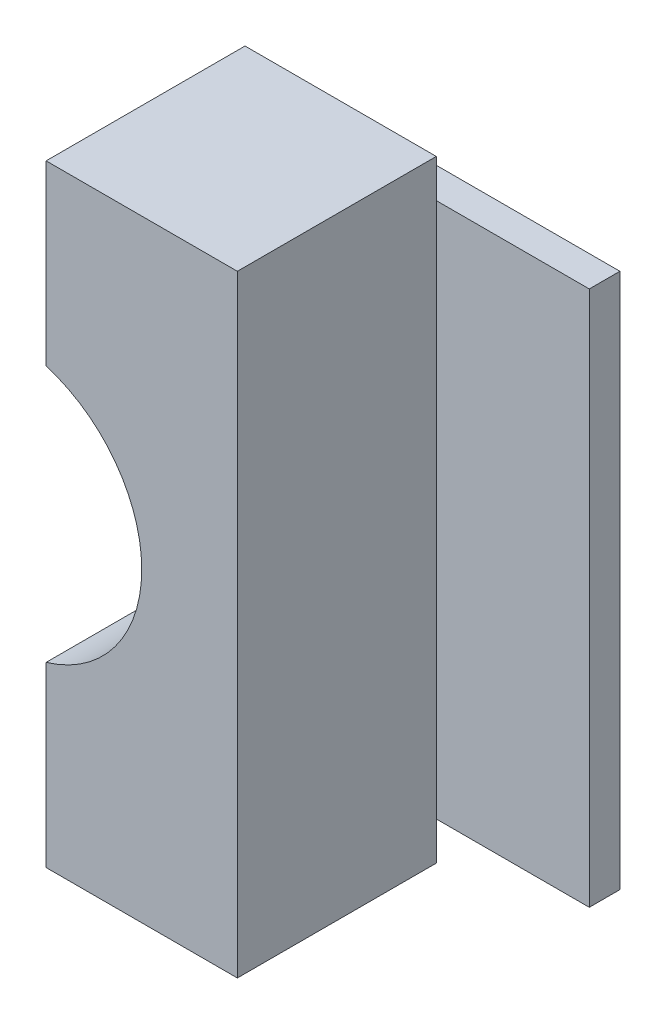
ISO-10303-21;
HEADER;
FILE_DESCRIPTION(('STEP AP214'),'2;1');
FILE_NAME('part.step','',(''),(''),'','','');
FILE_SCHEMA(('AUTOMOTIVE_DESIGN { 1 0 10303 214 1 1 1 1 }'));
ENDSEC;
DATA;
#1=APPLICATION_CONTEXT('core data for automotive mechanical design processes');
#2=APPLICATION_PROTOCOL_DEFINITION('international standard','automotive_design',2000,#1);
#3=PRODUCT_CONTEXT('',#1,'mechanical');
#4=PRODUCT('Part','Part','',(#3));
#5=PRODUCT_RELATED_PRODUCT_CATEGORY('part','',(#4));
#6=PRODUCT_DEFINITION_FORMATION('','',#4);
#7=PRODUCT_DEFINITION_CONTEXT('part definition',#1,'design');
#8=PRODUCT_DEFINITION('design','',#6,#7);
#9=PRODUCT_DEFINITION_SHAPE('','',#8);
#10=(LENGTH_UNIT() NAMED_UNIT(*) SI_UNIT(.MILLI.,.METRE.));
#11=(NAMED_UNIT(*) PLANE_ANGLE_UNIT() SI_UNIT($,.RADIAN.));
#12=(NAMED_UNIT(*) SI_UNIT($,.STERADIAN.) SOLID_ANGLE_UNIT());
#13=UNCERTAINTY_MEASURE_WITH_UNIT(LENGTH_MEASURE(1.E-05),#10,'distance_accuracy_value','');
#14=(GEOMETRIC_REPRESENTATION_CONTEXT(3) GLOBAL_UNCERTAINTY_ASSIGNED_CONTEXT((#13)) GLOBAL_UNIT_ASSIGNED_CONTEXT((#10,
#11,#12)) REPRESENTATION_CONTEXT('',''));
#15=CARTESIAN_POINT('',(0.,0.,0.));
#16=DIRECTION('',(0.,0.,1.));
#17=DIRECTION('',(1.,0.,0.));
#18=AXIS2_PLACEMENT_3D('',#15,#16,#17);
#19=CARTESIAN_POINT('',(0.125,-0.35,0.3));
#20=DIRECTION('',(-1.,0.,0.));
#21=DIRECTION('',(0.,0.,1.));
#22=AXIS2_PLACEMENT_3D('',#19,#20,#21);
#23=PLANE('',#22);
#24=DIRECTION('',(0.,1.,0.));
#25=VECTOR('',#24,1.);
#26=CARTESIAN_POINT('',(0.125,-0.35,0.04));
#27=LINE('',#26,#25);
#28=CARTESIAN_POINT('',(0.125,0.35,0.04));
#29=VERTEX_POINT('',#28);
#30=CARTESIAN_POINT('',(0.125,-0.35,0.04));
#31=VERTEX_POINT('',#30);
#32=EDGE_CURVE('E217',#29,#31,#27,.F.);
#33=ORIENTED_EDGE('',*,*,#32,.F.);
#34=DIRECTION('',(0.,1.,0.));
#35=VECTOR('',#34,1.);
#36=CARTESIAN_POINT('',(0.125,-0.4,0.04));
#37=LINE('',#36,#35);
#38=CARTESIAN_POINT('',(0.125,0.4,0.04));
#39=VERTEX_POINT('',#38);
#40=EDGE_CURVE('E88',#29,#39,#37,.T.);
#41=ORIENTED_EDGE('',*,*,#40,.T.);
#42=DIRECTION('',(0.,0.,-1.));
#43=VECTOR('',#42,1.);
#44=CARTESIAN_POINT('',(0.125,0.4,0.3));
#45=LINE('',#44,#43);
#46=CARTESIAN_POINT('',(0.125,0.4,0.3));
#47=VERTEX_POINT('',#46);
#48=EDGE_CURVE('E205',#39,#47,#45,.F.);
#49=ORIENTED_EDGE('',*,*,#48,.T.);
#50=DIRECTION('',(0.,1.,0.));
#51=VECTOR('',#50,1.);
#52=CARTESIAN_POINT('',(0.125,-0.35,0.3));
#53=LINE('',#52,#51);
#54=CARTESIAN_POINT('',(0.125,-0.4,0.3));
#55=VERTEX_POINT('',#54);
#56=EDGE_CURVE('E165',#55,#47,#53,.T.);
#57=ORIENTED_EDGE('',*,*,#56,.F.);
#58=DIRECTION('',(0.,0.,1.));
#59=VECTOR('',#58,1.);
#60=CARTESIAN_POINT('',(0.125,-0.4,0.3));
#61=LINE('',#60,#59);
#62=CARTESIAN_POINT('',(0.125,-0.4,0.04));
#63=VERTEX_POINT('',#62);
#64=EDGE_CURVE('E187',#55,#63,#61,.F.);
#65=ORIENTED_EDGE('',*,*,#64,.T.);
#66=DIRECTION('',(0.,1.,0.));
#67=VECTOR('',#66,1.);
#68=CARTESIAN_POINT('',(0.125,-0.4,0.04));
#69=LINE('',#68,#67);
#70=EDGE_CURVE('E166',#63,#31,#69,.T.);
#71=ORIENTED_EDGE('',*,*,#70,.T.);
#72=EDGE_LOOP('',(#33,#41,#49,#57,#65,#71));
#73=FACE_BOUND('',#72,.T.);
#74=ADVANCED_FACE('F17',(#73),#23,.F.);
#75=CARTESIAN_POINT('',(0.125,-0.35,0.04));
#76=DIRECTION('',(0.,0.,1.));
#77=DIRECTION('',(1.,0.,0.));
#78=AXIS2_PLACEMENT_3D('',#75,#76,#77);
#79=PLANE('',#78);
#80=DIRECTION('',(0.,1.,0.));
#81=VECTOR('',#80,1.);
#82=CARTESIAN_POINT('',(0.325,-0.35,0.04));
#83=LINE('',#82,#81);
#84=CARTESIAN_POINT('',(0.325,-0.35,0.04));
#85=VERTEX_POINT('',#84);
#86=CARTESIAN_POINT('',(0.325,0.35,0.04));
#87=VERTEX_POINT('',#86);
#88=EDGE_CURVE('E97',#85,#87,#83,.T.);
#89=ORIENTED_EDGE('',*,*,#88,.T.);
#90=DIRECTION('',(1.,0.,0.));
#91=VECTOR('',#90,1.);
#92=CARTESIAN_POINT('',(0.125,0.35,0.04));
#93=LINE('',#92,#91);
#94=EDGE_CURVE('E136',#87,#29,#93,.F.);
#95=ORIENTED_EDGE('',*,*,#94,.T.);
#96=ORIENTED_EDGE('',*,*,#32,.T.);
#97=DIRECTION('',(1.,0.,0.));
#98=VECTOR('',#97,1.);
#99=CARTESIAN_POINT('',(-0.125,-0.35,0.04));
#100=LINE('',#99,#98);
#101=EDGE_CURVE('E176',#31,#85,#100,.T.);
#102=ORIENTED_EDGE('',*,*,#101,.T.);
#103=EDGE_LOOP('',(#89,#95,#96,#102));
#104=FACE_BOUND('',#103,.T.);
#105=ADVANCED_FACE('F265',(#104),#79,.T.);
#106=CARTESIAN_POINT('',(-0.125,-0.4,0.04));
#107=DIRECTION('',(0.,0.,1.));
#108=DIRECTION('',(1.,0.,0.));
#109=AXIS2_PLACEMENT_3D('',#106,#107,#108);
#110=PLANE('',#109);
#111=DIRECTION('',(1.,0.,0.));
#112=VECTOR('',#111,1.);
#113=CARTESIAN_POINT('',(0.125,0.35,0.04));
#114=LINE('',#113,#112);
#115=CARTESIAN_POINT('',(-0.125,0.35,0.04));
#116=VERTEX_POINT('',#115);
#117=EDGE_CURVE('E212',#29,#116,#114,.F.);
#118=ORIENTED_EDGE('',*,*,#117,.T.);
#119=DIRECTION('',(0.,1.,0.));
#120=VECTOR('',#119,1.);
#121=CARTESIAN_POINT('',(-0.125,0.35,0.04));
#122=LINE('',#121,#120);
#123=CARTESIAN_POINT('',(-0.125,0.4,0.04));
#124=VERTEX_POINT('',#123);
#125=EDGE_CURVE('E200',#116,#124,#122,.T.);
#126=ORIENTED_EDGE('',*,*,#125,.T.);
#127=DIRECTION('',(1.,0.,0.));
#128=VECTOR('',#127,1.);
#129=CARTESIAN_POINT('',(0.125,0.4,0.04));
#130=LINE('',#129,#128);
#131=EDGE_CURVE('E203',#124,#39,#130,.T.);
#132=ORIENTED_EDGE('',*,*,#131,.T.);
#133=ORIENTED_EDGE('',*,*,#40,.F.);
#134=EDGE_LOOP('',(#118,#126,#132,#133));
#135=FACE_BOUND('',#134,.T.);
#136=ADVANCED_FACE('F283',(#135),#110,.F.);
#137=CARTESIAN_POINT('',(0.125,0.4,0.3));
#138=DIRECTION('',(0.,-1.,0.));
#139=DIRECTION('',(0.,0.,-1.));
#140=AXIS2_PLACEMENT_3D('',#137,#138,#139);
#141=PLANE('',#140);
#142=DIRECTION('',(0.,0.,-1.));
#143=VECTOR('',#142,1.);
#144=CARTESIAN_POINT('',(-0.125,0.4,0.3));
#145=LINE('',#144,#143);
#146=CARTESIAN_POINT('',(-0.125,0.4,0.3));
#147=VERTEX_POINT('',#146);
#148=EDGE_CURVE('E192',#124,#147,#145,.F.);
#149=ORIENTED_EDGE('',*,*,#148,.T.);
#150=DIRECTION('',(1.,0.,0.));
#151=VECTOR('',#150,1.);
#152=CARTESIAN_POINT('',(-0.125,0.4,0.3));
#153=LINE('',#152,#151);
#154=EDGE_CURVE('E57',#47,#147,#153,.F.);
#155=ORIENTED_EDGE('',*,*,#154,.F.);
#156=ORIENTED_EDGE('',*,*,#48,.F.);
#157=ORIENTED_EDGE('',*,*,#131,.F.);
#158=EDGE_LOOP('',(#149,#155,#156,#157));
#159=FACE_BOUND('',#158,.T.);
#160=ADVANCED_FACE('F282',(#159),#141,.F.);
#161=CARTESIAN_POINT('',(-0.125,-0.4,0.3));
#162=DIRECTION('',(0.,1.,0.));
#163=DIRECTION('',(0.,0.,1.));
#164=AXIS2_PLACEMENT_3D('',#161,#162,#163);
#165=PLANE('',#164);
#166=ORIENTED_EDGE('',*,*,#64,.F.);
#167=DIRECTION('',(1.,0.,0.));
#168=VECTOR('',#167,1.);
#169=CARTESIAN_POINT('',(-0.125,-0.4,0.3));
#170=LINE('',#169,#168);
#171=CARTESIAN_POINT('',(-0.125,-0.4,0.3));
#172=VERTEX_POINT('',#171);
#173=EDGE_CURVE('E162',#172,#55,#170,.T.);
#174=ORIENTED_EDGE('',*,*,#173,.F.);
#175=DIRECTION('',(0.,0.,-1.));
#176=VECTOR('',#175,1.);
#177=CARTESIAN_POINT('',(-0.125,-0.4,0.3));
#178=LINE('',#177,#176);
#179=CARTESIAN_POINT('',(-0.125,-0.4,0.04));
#180=VERTEX_POINT('',#179);
#181=EDGE_CURVE('E169',#172,#180,#178,.T.);
#182=ORIENTED_EDGE('',*,*,#181,.T.);
#183=DIRECTION('',(1.,0.,0.));
#184=VECTOR('',#183,1.);
#185=CARTESIAN_POINT('',(-0.125,-0.4,0.04));
#186=LINE('',#185,#184);
#187=EDGE_CURVE('E184',#180,#63,#186,.T.);
#188=ORIENTED_EDGE('',*,*,#187,.T.);
#189=EDGE_LOOP('',(#166,#174,#182,#188));
#190=FACE_BOUND('',#189,.T.);
#191=ADVANCED_FACE('F276',(#190),#165,.F.);
#192=CARTESIAN_POINT('',(-0.125,-0.4,0.04));
#193=DIRECTION('',(0.,0.,1.));
#194=DIRECTION('',(1.,0.,0.));
#195=AXIS2_PLACEMENT_3D('',#192,#193,#194);
#196=PLANE('',#195);
#197=DIRECTION('',(1.,0.,0.));
#198=VECTOR('',#197,1.);
#199=CARTESIAN_POINT('',(-0.125,-0.35,0.04));
#200=LINE('',#199,#198);
#201=CARTESIAN_POINT('',(-0.125,-0.35,0.04));
#202=VERTEX_POINT('',#201);
#203=EDGE_CURVE('E110',#202,#31,#200,.T.);
#204=ORIENTED_EDGE('',*,*,#203,.T.);
#205=ORIENTED_EDGE('',*,*,#70,.F.);
#206=ORIENTED_EDGE('',*,*,#187,.F.);
#207=DIRECTION('',(0.,1.,0.));
#208=VECTOR('',#207,1.);
#209=CARTESIAN_POINT('',(-0.125,0.35,0.04));
#210=LINE('',#209,#208);
#211=EDGE_CURVE('E172',#180,#202,#210,.T.);
#212=ORIENTED_EDGE('',*,*,#211,.T.);
#213=EDGE_LOOP('',(#204,#205,#206,#212));
#214=FACE_BOUND('',#213,.T.);
#215=ADVANCED_FACE('F271',(#214),#196,.F.);
#216=CARTESIAN_POINT('',(-0.125,-0.35,0.3));
#217=DIRECTION('',(0.,0.,1.));
#218=DIRECTION('',(1.,0.,0.));
#219=AXIS2_PLACEMENT_3D('',#216,#217,#218);
#220=PLANE('',#219);
#221=ORIENTED_EDGE('',*,*,#154,.T.);
#222=DIRECTION('',(0.,1.,0.));
#223=VECTOR('',#222,1.);
#224=CARTESIAN_POINT('',(-0.125,0.35,0.3));
#225=LINE('',#224,#223);
#226=CARTESIAN_POINT('',(-0.124999999999934,0.167705098312464,0.3));
#227=VERTEX_POINT('',#226);
#228=EDGE_CURVE('E48',#147,#227,#225,.F.);
#229=ORIENTED_EDGE('',*,*,#228,.T.);
#230=CARTESIAN_POINT('',(-0.175,0.,0.3));
#231=DIRECTION('',(0.,0.,1.));
#232=DIRECTION('',(1.,0.,0.));
#233=AXIS2_PLACEMENT_3D('',#230,#231,#232);
#234=CIRCLE('',#233,0.175);
#235=CARTESIAN_POINT('',(-0.125,-0.167705098312242,0.3));
#236=VERTEX_POINT('',#235);
#237=EDGE_CURVE('E20',#227,#236,#234,.F.);
#238=ORIENTED_EDGE('',*,*,#237,.T.);
#239=DIRECTION('',(0.,1.,0.));
#240=VECTOR('',#239,1.);
#241=CARTESIAN_POINT('',(-0.125,0.35,0.3));
#242=LINE('',#241,#240);
#243=EDGE_CURVE('E149',#236,#172,#242,.F.);
#244=ORIENTED_EDGE('',*,*,#243,.T.);
#245=ORIENTED_EDGE('',*,*,#173,.T.);
#246=ORIENTED_EDGE('',*,*,#56,.T.);
#247=EDGE_LOOP('',(#221,#229,#238,#244,#245,#246));
#248=FACE_BOUND('',#247,.T.);
#249=ADVANCED_FACE('F277',(#248),#220,.T.);
#250=CARTESIAN_POINT('',(-0.125,-0.35,0.3));
#251=DIRECTION('',(0.,1.,0.));
#252=DIRECTION('',(0.,0.,1.));
#253=AXIS2_PLACEMENT_3D('',#250,#251,#252);
#254=PLANE('',#253);
#255=DIRECTION('',(0.,0.,-1.));
#256=VECTOR('',#255,1.);
#257=CARTESIAN_POINT('',(-0.125,-0.35,0.3));
#258=LINE('',#257,#256);
#259=CARTESIAN_POINT('',(-0.125,-0.35,0.));
#260=VERTEX_POINT('',#259);
#261=EDGE_CURVE('E181',#202,#260,#258,.T.);
#262=ORIENTED_EDGE('',*,*,#261,.T.);
#263=DIRECTION('',(1.,0.,0.));
#264=VECTOR('',#263,1.);
#265=CARTESIAN_POINT('',(-0.125,-0.35,0.));
#266=LINE('',#265,#264);
#267=CARTESIAN_POINT('',(0.325,-0.35,0.));
#268=VERTEX_POINT('',#267);
#269=EDGE_CURVE('E118',#260,#268,#266,.T.);
#270=ORIENTED_EDGE('',*,*,#269,.T.);
#271=DIRECTION('',(0.,0.,1.));
#272=VECTOR('',#271,1.);
#273=CARTESIAN_POINT('',(0.325,-0.35,0.04));
#274=LINE('',#273,#272);
#275=EDGE_CURVE('E147',#268,#85,#274,.T.);
#276=ORIENTED_EDGE('',*,*,#275,.T.);
#277=ORIENTED_EDGE('',*,*,#101,.F.);
#278=ORIENTED_EDGE('',*,*,#203,.F.);
#279=EDGE_LOOP('',(#262,#270,#276,#277,#278));
#280=FACE_BOUND('',#279,.T.);
#281=ADVANCED_FACE('F267',(#280),#254,.F.);
#282=CARTESIAN_POINT('',(0.325,-0.35,0.04));
#283=DIRECTION('',(-1.,0.,0.));
#284=DIRECTION('',(0.,0.,1.));
#285=AXIS2_PLACEMENT_3D('',#282,#283,#284);
#286=PLANE('',#285);
#287=DIRECTION('',(0.,0.,-1.));
#288=VECTOR('',#287,1.);
#289=CARTESIAN_POINT('',(0.325,0.35,0.3));
#290=LINE('',#289,#288);
#291=CARTESIAN_POINT('',(0.325,0.35,0.));
#292=VERTEX_POINT('',#291);
#293=EDGE_CURVE('E131',#292,#87,#290,.F.);
#294=ORIENTED_EDGE('',*,*,#293,.T.);
#295=ORIENTED_EDGE('',*,*,#88,.F.);
#296=ORIENTED_EDGE('',*,*,#275,.F.);
#297=DIRECTION('',(0.,1.,0.));
#298=VECTOR('',#297,1.);
#299=CARTESIAN_POINT('',(0.325,-0.35,0.));
#300=LINE('',#299,#298);
#301=EDGE_CURVE('E142',#268,#292,#300,.T.);
#302=ORIENTED_EDGE('',*,*,#301,.T.);
#303=EDGE_LOOP('',(#294,#295,#296,#302));
#304=FACE_BOUND('',#303,.T.);
#305=ADVANCED_FACE('F145',(#304),#286,.F.);
#306=CARTESIAN_POINT('',(0.125,0.35,0.3));
#307=DIRECTION('',(0.,-1.,0.));
#308=DIRECTION('',(0.,0.,-1.));
#309=AXIS2_PLACEMENT_3D('',#306,#307,#308);
#310=PLANE('',#309);
#311=ORIENTED_EDGE('',*,*,#94,.F.);
#312=ORIENTED_EDGE('',*,*,#293,.F.);
#313=DIRECTION('',(1.,0.,0.));
#314=VECTOR('',#313,1.);
#315=CARTESIAN_POINT('',(-0.125,0.35,0.));
#316=LINE('',#315,#314);
#317=CARTESIAN_POINT('',(-0.125,0.35,0.));
#318=VERTEX_POINT('',#317);
#319=EDGE_CURVE('E134',#292,#318,#316,.F.);
#320=ORIENTED_EDGE('',*,*,#319,.T.);
#321=DIRECTION('',(0.,0.,-1.));
#322=VECTOR('',#321,1.);
#323=CARTESIAN_POINT('',(-0.125,0.35,0.3));
#324=LINE('',#323,#322);
#325=EDGE_CURVE('E125',#318,#116,#324,.F.);
#326=ORIENTED_EDGE('',*,*,#325,.T.);
#327=ORIENTED_EDGE('',*,*,#117,.F.);
#328=EDGE_LOOP('',(#311,#312,#320,#326,#327));
#329=FACE_BOUND('',#328,.T.);
#330=ADVANCED_FACE('F133',(#329),#310,.F.);
#331=CARTESIAN_POINT('',(-0.125,0.35,0.3));
#332=DIRECTION('',(1.,0.,0.));
#333=DIRECTION('',(0.,0.,-1.));
#334=AXIS2_PLACEMENT_3D('',#331,#332,#333);
#335=PLANE('',#334);
#336=DIRECTION('',(0.,0.,1.));
#337=VECTOR('',#336,1.);
#338=CARTESIAN_POINT('',(-0.124999999999867,0.167705098312445,0.977560739801));
#339=LINE('',#338,#337);
#340=CARTESIAN_POINT('',(-0.124999999999934,0.167705098312464,0.));
#341=VERTEX_POINT('',#340);
#342=EDGE_CURVE('E191',#341,#227,#339,.T.);
#343=ORIENTED_EDGE('',*,*,#342,.T.);
#344=ORIENTED_EDGE('',*,*,#228,.F.);
#345=ORIENTED_EDGE('',*,*,#148,.F.);
#346=ORIENTED_EDGE('',*,*,#125,.F.);
#347=ORIENTED_EDGE('',*,*,#325,.F.);
#348=DIRECTION('',(0.,1.,0.));
#349=VECTOR('',#348,1.);
#350=CARTESIAN_POINT('',(-0.125,-0.35,0.));
#351=LINE('',#350,#349);
#352=EDGE_CURVE('E143',#318,#341,#351,.F.);
#353=ORIENTED_EDGE('',*,*,#352,.T.);
#354=EDGE_LOOP('',(#343,#344,#345,#346,#347,#353));
#355=FACE_BOUND('',#354,.T.);
#356=ADVANCED_FACE('F279',(#355),#335,.F.);
#357=CARTESIAN_POINT('',(-0.175,0.,0.977560739801));
#358=DIRECTION('',(0.,0.,1.));
#359=DIRECTION('',(1.,0.,0.));
#360=AXIS2_PLACEMENT_3D('',#357,#358,#359);
#361=CYLINDRICAL_SURFACE('',#360,0.175);
#362=ORIENTED_EDGE('',*,*,#342,.F.);
#363=CARTESIAN_POINT('',(-0.175,0.,0.));
#364=DIRECTION('',(0.,0.,1.));
#365=DIRECTION('',(1.,0.,0.));
#366=AXIS2_PLACEMENT_3D('',#363,#364,#365);
#367=CIRCLE('',#366,0.175);
#368=CARTESIAN_POINT('',(-0.125,-0.167705098312242,0.));
#369=VERTEX_POINT('',#368);
#370=EDGE_CURVE('E26',#341,#369,#367,.F.);
#371=ORIENTED_EDGE('',*,*,#370,.T.);
#372=DIRECTION('',(0.,0.,-1.));
#373=VECTOR('',#372,1.);
#374=CARTESIAN_POINT('',(-0.125,-0.167705098312,0.3));
#375=LINE('',#374,#373);
#376=EDGE_CURVE('E34',#369,#236,#375,.F.);
#377=ORIENTED_EDGE('',*,*,#376,.T.);
#378=ORIENTED_EDGE('',*,*,#237,.F.);
#379=EDGE_LOOP('',(#362,#371,#377,#378));
#380=FACE_BOUND('',#379,.T.);
#381=ADVANCED_FACE('F278',(#380),#361,.F.);
#382=CARTESIAN_POINT('',(-0.125,0.35,0.3));
#383=DIRECTION('',(1.,0.,0.));
#384=DIRECTION('',(0.,0.,-1.));
#385=AXIS2_PLACEMENT_3D('',#382,#383,#384);
#386=PLANE('',#385);
#387=ORIENTED_EDGE('',*,*,#376,.F.);
#388=DIRECTION('',(0.,1.,0.));
#389=VECTOR('',#388,1.);
#390=CARTESIAN_POINT('',(-0.125,-0.35,0.));
#391=LINE('',#390,#389);
#392=EDGE_CURVE('E11',#369,#260,#391,.F.);
#393=ORIENTED_EDGE('',*,*,#392,.T.);
#394=ORIENTED_EDGE('',*,*,#261,.F.);
#395=ORIENTED_EDGE('',*,*,#211,.F.);
#396=ORIENTED_EDGE('',*,*,#181,.F.);
#397=ORIENTED_EDGE('',*,*,#243,.F.);
#398=EDGE_LOOP('',(#387,#393,#394,#395,#396,#397));
#399=FACE_BOUND('',#398,.T.);
#400=ADVANCED_FACE('F273',(#399),#386,.F.);
#401=CARTESIAN_POINT('',(-0.125,-0.35,0.));
#402=DIRECTION('',(0.,0.,1.));
#403=DIRECTION('',(1.,0.,0.));
#404=AXIS2_PLACEMENT_3D('',#401,#402,#403);
#405=PLANE('',#404);
#406=ORIENTED_EDGE('',*,*,#370,.F.);
#407=ORIENTED_EDGE('',*,*,#352,.F.);
#408=ORIENTED_EDGE('',*,*,#319,.F.);
#409=ORIENTED_EDGE('',*,*,#301,.F.);
#410=ORIENTED_EDGE('',*,*,#269,.F.);
#411=ORIENTED_EDGE('',*,*,#392,.F.);
#412=EDGE_LOOP('',(#406,#407,#408,#409,#410,#411));
#413=FACE_BOUND('',#412,.T.);
#414=ADVANCED_FACE('F141',(#413),#405,.F.);
#415=CLOSED_SHELL('',(#74,#105,#136,#160,#191,#215,#249,#281,#305,#330,#356,#381,#400,#414));
#416=MANIFOLD_SOLID_BREP('B1',#415);
#417=ADVANCED_BREP_SHAPE_REPRESENTATION('',(#18,#416),#14);
#418=SHAPE_DEFINITION_REPRESENTATION(#9,#417);
ENDSEC;
END-ISO-10303-21;
